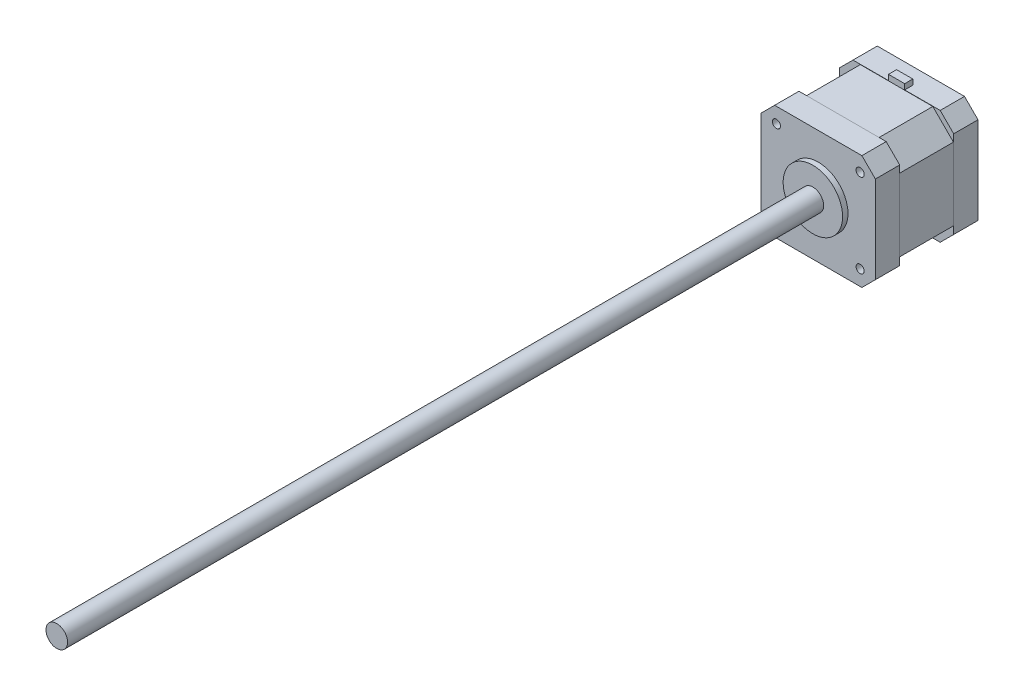
ISO-10303-21;
HEADER;
FILE_DESCRIPTION(('STEP AP214'),'2;1');
FILE_NAME('part.step','',(''),(''),'','','');
FILE_SCHEMA(('AUTOMOTIVE_DESIGN { 1 0 10303 214 1 1 1 1 }'));
ENDSEC;
DATA;
#1=APPLICATION_CONTEXT('core data for automotive mechanical design processes');
#2=APPLICATION_PROTOCOL_DEFINITION('international standard','automotive_design',2000,#1);
#3=PRODUCT_CONTEXT('',#1,'mechanical');
#4=PRODUCT('Part','Part','',(#3));
#5=PRODUCT_RELATED_PRODUCT_CATEGORY('part','',(#4));
#6=PRODUCT_DEFINITION_FORMATION('','',#4);
#7=PRODUCT_DEFINITION_CONTEXT('part definition',#1,'design');
#8=PRODUCT_DEFINITION('design','',#6,#7);
#9=PRODUCT_DEFINITION_SHAPE('','',#8);
#10=(LENGTH_UNIT() NAMED_UNIT(*) SI_UNIT(.MILLI.,.METRE.));
#11=(NAMED_UNIT(*) PLANE_ANGLE_UNIT() SI_UNIT($,.RADIAN.));
#12=(NAMED_UNIT(*) SI_UNIT($,.STERADIAN.) SOLID_ANGLE_UNIT());
#13=UNCERTAINTY_MEASURE_WITH_UNIT(LENGTH_MEASURE(1.E-05),#10,'distance_accuracy_value','');
#14=(GEOMETRIC_REPRESENTATION_CONTEXT(3) GLOBAL_UNCERTAINTY_ASSIGNED_CONTEXT((#13)) GLOBAL_UNIT_ASSIGNED_CONTEXT((#10,
#11,#12)) REPRESENTATION_CONTEXT('',''));
#15=CARTESIAN_POINT('',(0.,0.,0.));
#16=DIRECTION('',(0.,0.,1.));
#17=DIRECTION('',(1.,0.,0.));
#18=AXIS2_PLACEMENT_3D('',#15,#16,#17);
#19=CARTESIAN_POINT('',(-3.,23.15,-32.));
#20=DIRECTION('',(0.,0.,1.));
#21=DIRECTION('',(1.,0.,0.));
#22=AXIS2_PLACEMENT_3D('',#19,#20,#21);
#23=PLANE('',#22);
#24=DIRECTION('',(0.,1.,0.));
#25=VECTOR('',#24,1.);
#26=CARTESIAN_POINT('',(-3.,23.15,-32.));
#27=LINE('',#26,#25);
#28=CARTESIAN_POINT('',(-3.,21.15,-32.));
#29=VERTEX_POINT('',#28);
#30=CARTESIAN_POINT('',(-3.,23.15,-32.));
#31=VERTEX_POINT('',#30);
#32=EDGE_CURVE('E394',#29,#31,#27,.T.);
#33=ORIENTED_EDGE('',*,*,#32,.T.);
#34=DIRECTION('',(1.,0.,0.));
#35=VECTOR('',#34,1.);
#36=CARTESIAN_POINT('',(0.,23.15,-32.));
#37=LINE('',#36,#35);
#38=CARTESIAN_POINT('',(3.,23.15,-32.));
#39=VERTEX_POINT('',#38);
#40=EDGE_CURVE('E398',#31,#39,#37,.T.);
#41=ORIENTED_EDGE('',*,*,#40,.T.);
#42=DIRECTION('',(0.,1.,0.));
#43=VECTOR('',#42,1.);
#44=CARTESIAN_POINT('',(3.,23.15,-32.));
#45=LINE('',#44,#43);
#46=CARTESIAN_POINT('',(3.,21.15,-32.));
#47=VERTEX_POINT('',#46);
#48=EDGE_CURVE('E400',#39,#47,#45,.F.);
#49=ORIENTED_EDGE('',*,*,#48,.T.);
#50=DIRECTION('',(-1.,0.,0.));
#51=VECTOR('',#50,1.);
#52=CARTESIAN_POINT('',(-21.15,21.15,-32.));
#53=LINE('',#52,#51);
#54=EDGE_CURVE('E386',#29,#47,#53,.F.);
#55=ORIENTED_EDGE('',*,*,#54,.F.);
#56=EDGE_LOOP('',(#33,#41,#49,#55));
#57=FACE_BOUND('',#56,.T.);
#58=ADVANCED_FACE('F17',(#57),#23,.F.);
#59=CARTESIAN_POINT('',(0.,0.,-38.));
#60=DIRECTION('',(0.,0.,1.));
#61=DIRECTION('',(1.,0.,0.));
#62=AXIS2_PLACEMENT_3D('',#59,#60,#61);
#63=PLANE('',#62);
#64=DIRECTION('',(-0.707106781186549,0.707106781186546,0.));
#65=VECTOR('',#64,1.);
#66=CARTESIAN_POINT('',(-21.15,-16.15,-38.));
#67=LINE('',#66,#65);
#68=CARTESIAN_POINT('',(-16.15,-21.15,-38.));
#69=VERTEX_POINT('',#68);
#70=CARTESIAN_POINT('',(-21.15,-16.15,-38.));
#71=VERTEX_POINT('',#70);
#72=EDGE_CURVE('E365',#69,#71,#67,.T.);
#73=ORIENTED_EDGE('',*,*,#72,.T.);
#74=DIRECTION('',(0.,1.,0.));
#75=VECTOR('',#74,1.);
#76=CARTESIAN_POINT('',(-21.15,21.15,-38.));
#77=LINE('',#76,#75);
#78=CARTESIAN_POINT('',(-21.15,16.15,-38.));
#79=VERTEX_POINT('',#78);
#80=EDGE_CURVE('E368',#79,#71,#77,.F.);
#81=ORIENTED_EDGE('',*,*,#80,.F.);
#82=DIRECTION('',(0.707106781186546,0.707106781186549,0.));
#83=VECTOR('',#82,1.);
#84=CARTESIAN_POINT('',(-16.15,21.15,-38.));
#85=LINE('',#84,#83);
#86=CARTESIAN_POINT('',(-16.15,21.15,-38.));
#87=VERTEX_POINT('',#86);
#88=EDGE_CURVE('E376',#79,#87,#85,.T.);
#89=ORIENTED_EDGE('',*,*,#88,.T.);
#90=DIRECTION('',(-1.,0.,0.));
#91=VECTOR('',#90,1.);
#92=CARTESIAN_POINT('',(-21.15,21.15,-38.));
#93=LINE('',#92,#91);
#94=CARTESIAN_POINT('',(16.15,21.15,-38.));
#95=VERTEX_POINT('',#94);
#96=EDGE_CURVE('E378',#95,#87,#93,.T.);
#97=ORIENTED_EDGE('',*,*,#96,.F.);
#98=DIRECTION('',(0.707106781186549,-0.707106781186546,0.));
#99=VECTOR('',#98,1.);
#100=CARTESIAN_POINT('',(21.15,16.15,-38.));
#101=LINE('',#100,#99);
#102=CARTESIAN_POINT('',(21.15,16.15,-38.));
#103=VERTEX_POINT('',#102);
#104=EDGE_CURVE('E404',#95,#103,#101,.T.);
#105=ORIENTED_EDGE('',*,*,#104,.T.);
#106=DIRECTION('',(0.,1.,0.));
#107=VECTOR('',#106,1.);
#108=CARTESIAN_POINT('',(21.15,21.15,-38.));
#109=LINE('',#108,#107);
#110=CARTESIAN_POINT('',(21.15,-16.15,-38.));
#111=VERTEX_POINT('',#110);
#112=EDGE_CURVE('E207',#111,#103,#109,.T.);
#113=ORIENTED_EDGE('',*,*,#112,.F.);
#114=DIRECTION('',(-0.707106781186546,-0.707106781186549,0.));
#115=VECTOR('',#114,1.);
#116=CARTESIAN_POINT('',(16.15,-21.15,-38.));
#117=LINE('',#116,#115);
#118=CARTESIAN_POINT('',(16.15,-21.15,-38.));
#119=VERTEX_POINT('',#118);
#120=EDGE_CURVE('E199',#111,#119,#117,.T.);
#121=ORIENTED_EDGE('',*,*,#120,.T.);
#122=DIRECTION('',(1.,0.,0.));
#123=VECTOR('',#122,1.);
#124=CARTESIAN_POINT('',(-21.15,-21.15,-38.));
#125=LINE('',#124,#123);
#126=EDGE_CURVE('E204',#69,#119,#125,.T.);
#127=ORIENTED_EDGE('',*,*,#126,.F.);
#128=EDGE_LOOP('',(#73,#81,#89,#97,#105,#113,#121,#127));
#129=FACE_BOUND('',#128,.T.);
#130=ADVANCED_FACE('F203',(#129),#63,.F.);
#131=CARTESIAN_POINT('',(-21.15,-21.15,-38.));
#132=DIRECTION('',(0.,-1.,0.));
#133=DIRECTION('',(0.,0.,-1.));
#134=AXIS2_PLACEMENT_3D('',#131,#132,#133);
#135=PLANE('',#134);
#136=DIRECTION('',(0.,0.,1.));
#137=VECTOR('',#136,1.);
#138=CARTESIAN_POINT('',(-16.15,-21.15,-38.));
#139=LINE('',#138,#137);
#140=CARTESIAN_POINT('',(-16.15,-21.15,-29.));
#141=VERTEX_POINT('',#140);
#142=EDGE_CURVE('E215',#141,#69,#139,.F.);
#143=ORIENTED_EDGE('',*,*,#142,.T.);
#144=ORIENTED_EDGE('',*,*,#126,.T.);
#145=DIRECTION('',(0.,0.,1.));
#146=VECTOR('',#145,1.);
#147=CARTESIAN_POINT('',(16.15,-21.15,-38.));
#148=LINE('',#147,#146);
#149=CARTESIAN_POINT('',(16.15,-21.15,-29.));
#150=VERTEX_POINT('',#149);
#151=EDGE_CURVE('E209',#119,#150,#148,.T.);
#152=ORIENTED_EDGE('',*,*,#151,.T.);
#153=DIRECTION('',(1.,0.,0.));
#154=VECTOR('',#153,1.);
#155=CARTESIAN_POINT('',(0.,-21.15,-29.));
#156=LINE('',#155,#154);
#157=EDGE_CURVE('E361',#141,#150,#156,.T.);
#158=ORIENTED_EDGE('',*,*,#157,.F.);
#159=EDGE_LOOP('',(#143,#144,#152,#158));
#160=FACE_BOUND('',#159,.T.);
#161=ADVANCED_FACE('F212',(#160),#135,.T.);
#162=CARTESIAN_POINT('',(16.15,-21.15,-38.));
#163=DIRECTION('',(-0.707106781186549,0.707106781186546,0.));
#164=DIRECTION('',(-0.707106781186546,-0.707106781186549,0.));
#165=AXIS2_PLACEMENT_3D('',#162,#163,#164);
#166=PLANE('',#165);
#167=ORIENTED_EDGE('',*,*,#151,.F.);
#168=ORIENTED_EDGE('',*,*,#120,.F.);
#169=DIRECTION('',(0.,0.,-1.));
#170=VECTOR('',#169,1.);
#171=CARTESIAN_POINT('',(21.15,-16.15,-38.));
#172=LINE('',#171,#170);
#173=CARTESIAN_POINT('',(21.15,-16.15,-29.));
#174=VERTEX_POINT('',#173);
#175=EDGE_CURVE('E222',#174,#111,#172,.T.);
#176=ORIENTED_EDGE('',*,*,#175,.F.);
#177=DIRECTION('',(0.707106781186547,0.707106781186547,0.));
#178=VECTOR('',#177,1.);
#179=CARTESIAN_POINT('',(16.15,-21.15,-29.));
#180=LINE('',#179,#178);
#181=EDGE_CURVE('E220',#150,#174,#180,.T.);
#182=ORIENTED_EDGE('',*,*,#181,.F.);
#183=EDGE_LOOP('',(#167,#168,#176,#182));
#184=FACE_BOUND('',#183,.T.);
#185=ADVANCED_FACE('F218',(#184),#166,.F.);
#186=CARTESIAN_POINT('',(21.15,21.15,-38.));
#187=DIRECTION('',(1.,0.,0.));
#188=DIRECTION('',(0.,0.,-1.));
#189=AXIS2_PLACEMENT_3D('',#186,#187,#188);
#190=PLANE('',#189);
#191=ORIENTED_EDGE('',*,*,#175,.T.);
#192=ORIENTED_EDGE('',*,*,#112,.T.);
#193=DIRECTION('',(0.,0.,1.));
#194=VECTOR('',#193,1.);
#195=CARTESIAN_POINT('',(21.15,16.15,-38.));
#196=LINE('',#195,#194);
#197=CARTESIAN_POINT('',(21.15,16.15,-29.));
#198=VERTEX_POINT('',#197);
#199=EDGE_CURVE('E402',#103,#198,#196,.T.);
#200=ORIENTED_EDGE('',*,*,#199,.T.);
#201=DIRECTION('',(0.,1.,0.));
#202=VECTOR('',#201,1.);
#203=CARTESIAN_POINT('',(21.15,0.,-29.));
#204=LINE('',#203,#202);
#205=EDGE_CURVE('E357',#174,#198,#204,.T.);
#206=ORIENTED_EDGE('',*,*,#205,.F.);
#207=EDGE_LOOP('',(#191,#192,#200,#206));
#208=FACE_BOUND('',#207,.T.);
#209=ADVANCED_FACE('F407',(#208),#190,.T.);
#210=CARTESIAN_POINT('',(21.15,16.15,-38.));
#211=DIRECTION('',(-0.707106781186546,-0.707106781186549,0.));
#212=DIRECTION('',(0.707106781186549,-0.707106781186546,0.));
#213=AXIS2_PLACEMENT_3D('',#210,#211,#212);
#214=PLANE('',#213);
#215=DIRECTION('',(-0.707106781186547,0.707106781186547,0.));
#216=VECTOR('',#215,1.);
#217=CARTESIAN_POINT('',(21.15,16.15,-29.));
#218=LINE('',#217,#216);
#219=CARTESIAN_POINT('',(16.15,21.15,-29.));
#220=VERTEX_POINT('',#219);
#221=EDGE_CURVE('E354',#198,#220,#218,.T.);
#222=ORIENTED_EDGE('',*,*,#221,.F.);
#223=ORIENTED_EDGE('',*,*,#199,.F.);
#224=ORIENTED_EDGE('',*,*,#104,.F.);
#225=DIRECTION('',(0.,0.,1.));
#226=VECTOR('',#225,1.);
#227=CARTESIAN_POINT('',(16.15,21.15,-38.));
#228=LINE('',#227,#226);
#229=EDGE_CURVE('E381',#220,#95,#228,.F.);
#230=ORIENTED_EDGE('',*,*,#229,.F.);
#231=EDGE_LOOP('',(#222,#223,#224,#230));
#232=FACE_BOUND('',#231,.T.);
#233=ADVANCED_FACE('F411',(#232),#214,.F.);
#234=CARTESIAN_POINT('',(3.,23.15,-29.));
#235=DIRECTION('',(-1.,0.,0.));
#236=DIRECTION('',(0.,0.,1.));
#237=AXIS2_PLACEMENT_3D('',#234,#235,#236);
#238=PLANE('',#237);
#239=ORIENTED_EDGE('',*,*,#48,.F.);
#240=DIRECTION('',(0.,0.,-1.));
#241=VECTOR('',#240,1.);
#242=CARTESIAN_POINT('',(3.,23.15,0.));
#243=LINE('',#242,#241);
#244=CARTESIAN_POINT('',(3.,23.15,-29.));
#245=VERTEX_POINT('',#244);
#246=EDGE_CURVE('E396',#39,#245,#243,.F.);
#247=ORIENTED_EDGE('',*,*,#246,.T.);
#248=DIRECTION('',(0.,1.,0.));
#249=VECTOR('',#248,1.);
#250=CARTESIAN_POINT('',(3.,0.,-29.));
#251=LINE('',#250,#249);
#252=CARTESIAN_POINT('',(3.,21.15,-29.));
#253=VERTEX_POINT('',#252);
#254=EDGE_CURVE('E348',#253,#245,#251,.T.);
#255=ORIENTED_EDGE('',*,*,#254,.F.);
#256=DIRECTION('',(0.,0.,1.));
#257=VECTOR('',#256,1.);
#258=CARTESIAN_POINT('',(3.,21.15,-38.));
#259=LINE('',#258,#257);
#260=EDGE_CURVE('E384',#47,#253,#259,.T.);
#261=ORIENTED_EDGE('',*,*,#260,.F.);
#262=EDGE_LOOP('',(#239,#247,#255,#261));
#263=FACE_BOUND('',#262,.T.);
#264=ADVANCED_FACE('F436',(#263),#238,.F.);
#265=CARTESIAN_POINT('',(0.,23.15,0.));
#266=DIRECTION('',(0.,-1.,0.));
#267=DIRECTION('',(0.,0.,-1.));
#268=AXIS2_PLACEMENT_3D('',#265,#266,#267);
#269=PLANE('',#268);
#270=DIRECTION('',(1.,0.,0.));
#271=VECTOR('',#270,1.);
#272=CARTESIAN_POINT('',(0.,23.15,-29.));
#273=LINE('',#272,#271);
#274=CARTESIAN_POINT('',(-3.,23.15,-29.));
#275=VERTEX_POINT('',#274);
#276=EDGE_CURVE('E345',#245,#275,#273,.F.);
#277=ORIENTED_EDGE('',*,*,#276,.F.);
#278=ORIENTED_EDGE('',*,*,#246,.F.);
#279=ORIENTED_EDGE('',*,*,#40,.F.);
#280=DIRECTION('',(0.,0.,-1.));
#281=VECTOR('',#280,1.);
#282=CARTESIAN_POINT('',(-3.,23.15,-29.));
#283=LINE('',#282,#281);
#284=EDGE_CURVE('E392',#31,#275,#283,.F.);
#285=ORIENTED_EDGE('',*,*,#284,.T.);
#286=EDGE_LOOP('',(#277,#278,#279,#285));
#287=FACE_BOUND('',#286,.T.);
#288=ADVANCED_FACE('F440',(#287),#269,.F.);
#289=CARTESIAN_POINT('',(-3.,23.15,-29.));
#290=DIRECTION('',(1.,0.,0.));
#291=DIRECTION('',(0.,0.,-1.));
#292=AXIS2_PLACEMENT_3D('',#289,#290,#291);
#293=PLANE('',#292);
#294=DIRECTION('',(0.,1.,0.));
#295=VECTOR('',#294,1.);
#296=CARTESIAN_POINT('',(-3.,0.,-29.));
#297=LINE('',#296,#295);
#298=CARTESIAN_POINT('',(-3.,21.15,-29.));
#299=VERTEX_POINT('',#298);
#300=EDGE_CURVE('E342',#275,#299,#297,.F.);
#301=ORIENTED_EDGE('',*,*,#300,.F.);
#302=ORIENTED_EDGE('',*,*,#284,.F.);
#303=ORIENTED_EDGE('',*,*,#32,.F.);
#304=DIRECTION('',(0.,0.,1.));
#305=VECTOR('',#304,1.);
#306=CARTESIAN_POINT('',(-3.,21.15,-38.));
#307=LINE('',#306,#305);
#308=EDGE_CURVE('E389',#299,#29,#307,.F.);
#309=ORIENTED_EDGE('',*,*,#308,.F.);
#310=EDGE_LOOP('',(#301,#302,#303,#309));
#311=FACE_BOUND('',#310,.T.);
#312=ADVANCED_FACE('F444',(#311),#293,.F.);
#313=CARTESIAN_POINT('',(-21.15,21.15,-38.));
#314=DIRECTION('',(0.,1.,0.));
#315=DIRECTION('',(-1.,0.,0.));
#316=AXIS2_PLACEMENT_3D('',#313,#314,#315);
#317=PLANE('',#316);
#318=DIRECTION('',(0.,0.,1.));
#319=VECTOR('',#318,1.);
#320=CARTESIAN_POINT('',(-16.15,21.15,-38.));
#321=LINE('',#320,#319);
#322=CARTESIAN_POINT('',(-16.15,21.15,-29.));
#323=VERTEX_POINT('',#322);
#324=EDGE_CURVE('E374',#87,#323,#321,.T.);
#325=ORIENTED_EDGE('',*,*,#324,.T.);
#326=DIRECTION('',(1.,0.,0.));
#327=VECTOR('',#326,1.);
#328=CARTESIAN_POINT('',(0.,21.15,-29.));
#329=LINE('',#328,#327);
#330=EDGE_CURVE('E339',#299,#323,#329,.F.);
#331=ORIENTED_EDGE('',*,*,#330,.F.);
#332=ORIENTED_EDGE('',*,*,#308,.T.);
#333=ORIENTED_EDGE('',*,*,#54,.T.);
#334=ORIENTED_EDGE('',*,*,#260,.T.);
#335=DIRECTION('',(1.,0.,0.));
#336=VECTOR('',#335,1.);
#337=CARTESIAN_POINT('',(0.,21.15,-29.));
#338=LINE('',#337,#336);
#339=EDGE_CURVE('E351',#220,#253,#338,.F.);
#340=ORIENTED_EDGE('',*,*,#339,.F.);
#341=ORIENTED_EDGE('',*,*,#229,.T.);
#342=ORIENTED_EDGE('',*,*,#96,.T.);
#343=EDGE_LOOP('',(#325,#331,#332,#333,#334,#340,#341,#342));
#344=FACE_BOUND('',#343,.T.);
#345=ADVANCED_FACE('F429',(#344),#317,.T.);
#346=CARTESIAN_POINT('',(-16.15,21.15,-38.));
#347=DIRECTION('',(0.707106781186549,-0.707106781186546,0.));
#348=DIRECTION('',(0.707106781186546,0.707106781186549,0.));
#349=AXIS2_PLACEMENT_3D('',#346,#347,#348);
#350=PLANE('',#349);
#351=DIRECTION('',(-0.707106781186547,-0.707106781186547,0.));
#352=VECTOR('',#351,1.);
#353=CARTESIAN_POINT('',(-16.15,21.15,-29.));
#354=LINE('',#353,#352);
#355=CARTESIAN_POINT('',(-21.15,16.15,-29.));
#356=VERTEX_POINT('',#355);
#357=EDGE_CURVE('E336',#323,#356,#354,.T.);
#358=ORIENTED_EDGE('',*,*,#357,.F.);
#359=ORIENTED_EDGE('',*,*,#324,.F.);
#360=ORIENTED_EDGE('',*,*,#88,.F.);
#361=DIRECTION('',(0.,0.,1.));
#362=VECTOR('',#361,1.);
#363=CARTESIAN_POINT('',(-21.15,16.15,-38.));
#364=LINE('',#363,#362);
#365=EDGE_CURVE('E371',#356,#79,#364,.F.);
#366=ORIENTED_EDGE('',*,*,#365,.F.);
#367=EDGE_LOOP('',(#358,#359,#360,#366));
#368=FACE_BOUND('',#367,.T.);
#369=ADVANCED_FACE('F426',(#368),#350,.F.);
#370=CARTESIAN_POINT('',(-21.15,21.15,-38.));
#371=DIRECTION('',(-1.,0.,0.));
#372=DIRECTION('',(0.,0.,1.));
#373=AXIS2_PLACEMENT_3D('',#370,#371,#372);
#374=PLANE('',#373);
#375=ORIENTED_EDGE('',*,*,#365,.T.);
#376=ORIENTED_EDGE('',*,*,#80,.T.);
#377=DIRECTION('',(0.,0.,1.));
#378=VECTOR('',#377,1.);
#379=CARTESIAN_POINT('',(-21.15,-16.15,-38.));
#380=LINE('',#379,#378);
#381=CARTESIAN_POINT('',(-21.15,-16.15,-29.));
#382=VERTEX_POINT('',#381);
#383=EDGE_CURVE('E363',#71,#382,#380,.T.);
#384=ORIENTED_EDGE('',*,*,#383,.T.);
#385=DIRECTION('',(0.,1.,0.));
#386=VECTOR('',#385,1.);
#387=CARTESIAN_POINT('',(-21.15,0.,-29.));
#388=LINE('',#387,#386);
#389=EDGE_CURVE('E333',#356,#382,#388,.F.);
#390=ORIENTED_EDGE('',*,*,#389,.F.);
#391=EDGE_LOOP('',(#375,#376,#384,#390));
#392=FACE_BOUND('',#391,.T.);
#393=ADVANCED_FACE('F422',(#392),#374,.T.);
#394=CARTESIAN_POINT('',(-21.15,-16.15,-38.));
#395=DIRECTION('',(0.707106781186546,0.707106781186549,0.));
#396=DIRECTION('',(-0.707106781186549,0.707106781186546,0.));
#397=AXIS2_PLACEMENT_3D('',#394,#395,#396);
#398=PLANE('',#397);
#399=ORIENTED_EDGE('',*,*,#383,.F.);
#400=ORIENTED_EDGE('',*,*,#72,.F.);
#401=ORIENTED_EDGE('',*,*,#142,.F.);
#402=DIRECTION('',(0.707106781186547,-0.707106781186547,0.));
#403=VECTOR('',#402,1.);
#404=CARTESIAN_POINT('',(-21.15,-16.15,-29.));
#405=LINE('',#404,#403);
#406=EDGE_CURVE('E330',#382,#141,#405,.T.);
#407=ORIENTED_EDGE('',*,*,#406,.F.);
#408=EDGE_LOOP('',(#399,#400,#401,#407));
#409=FACE_BOUND('',#408,.T.);
#410=ADVANCED_FACE('F419',(#409),#398,.F.);
#411=CARTESIAN_POINT('',(0.,0.,-29.));
#412=DIRECTION('',(0.,0.,1.));
#413=DIRECTION('',(1.,0.,0.));
#414=AXIS2_PLACEMENT_3D('',#411,#412,#413);
#415=PLANE('',#414);
#416=DIRECTION('',(1.,0.,0.));
#417=VECTOR('',#416,1.);
#418=CARTESIAN_POINT('',(-21.05,21.05,-29.));
#419=LINE('',#418,#417);
#420=CARTESIAN_POINT('',(13.4215728752538,21.05,-29.));
#421=VERTEX_POINT('',#420);
#422=CARTESIAN_POINT('',(-13.4215728752538,21.05,-29.));
#423=VERTEX_POINT('',#422);
#424=EDGE_CURVE('E314',#421,#423,#419,.F.);
#425=ORIENTED_EDGE('',*,*,#424,.F.);
#426=DIRECTION('',(0.707106781186548,-0.707106781186548,0.));
#427=VECTOR('',#426,1.);
#428=CARTESIAN_POINT('',(13.3215728752538,21.15,-29.));
#429=LINE('',#428,#427);
#430=CARTESIAN_POINT('',(21.05,13.4215728752538,-29.));
#431=VERTEX_POINT('',#430);
#432=EDGE_CURVE('E309',#421,#431,#429,.T.);
#433=ORIENTED_EDGE('',*,*,#432,.T.);
#434=DIRECTION('',(0.,1.,0.));
#435=VECTOR('',#434,1.);
#436=CARTESIAN_POINT('',(21.05,-21.05,-29.));
#437=LINE('',#436,#435);
#438=CARTESIAN_POINT('',(21.05,-13.4215728752538,-29.));
#439=VERTEX_POINT('',#438);
#440=EDGE_CURVE('E303',#439,#431,#437,.T.);
#441=ORIENTED_EDGE('',*,*,#440,.F.);
#442=DIRECTION('',(-0.707106781186548,-0.707106781186548,0.));
#443=VECTOR('',#442,1.);
#444=CARTESIAN_POINT('',(13.3215728752538,-21.15,-29.));
#445=LINE('',#444,#443);
#446=CARTESIAN_POINT('',(13.4215728752538,-21.05,-29.));
#447=VERTEX_POINT('',#446);
#448=EDGE_CURVE('E295',#439,#447,#445,.T.);
#449=ORIENTED_EDGE('',*,*,#448,.T.);
#450=DIRECTION('',(1.,0.,0.));
#451=VECTOR('',#450,1.);
#452=CARTESIAN_POINT('',(-21.05,-21.05,-29.));
#453=LINE('',#452,#451);
#454=CARTESIAN_POINT('',(-13.4215728752538,-21.05,-29.));
#455=VERTEX_POINT('',#454);
#456=EDGE_CURVE('E288',#455,#447,#453,.T.);
#457=ORIENTED_EDGE('',*,*,#456,.F.);
#458=DIRECTION('',(-0.707106781186548,0.707106781186548,0.));
#459=VECTOR('',#458,1.);
#460=CARTESIAN_POINT('',(-13.3215728752538,-21.15,-29.));
#461=LINE('',#460,#459);
#462=CARTESIAN_POINT('',(-21.05,-13.4215728752538,-29.));
#463=VERTEX_POINT('',#462);
#464=EDGE_CURVE('E328',#455,#463,#461,.T.);
#465=ORIENTED_EDGE('',*,*,#464,.T.);
#466=DIRECTION('',(0.,1.,0.));
#467=VECTOR('',#466,1.);
#468=CARTESIAN_POINT('',(-21.05,-21.05,-29.));
#469=LINE('',#468,#467);
#470=CARTESIAN_POINT('',(-21.05,13.4215728752538,-29.));
#471=VERTEX_POINT('',#470);
#472=EDGE_CURVE('E322',#471,#463,#469,.F.);
#473=ORIENTED_EDGE('',*,*,#472,.F.);
#474=DIRECTION('',(0.707106781186548,0.707106781186548,0.));
#475=VECTOR('',#474,1.);
#476=CARTESIAN_POINT('',(-13.3215728752538,21.15,-29.));
#477=LINE('',#476,#475);
#478=EDGE_CURVE('E317',#471,#423,#477,.T.);
#479=ORIENTED_EDGE('',*,*,#478,.T.);
#480=EDGE_LOOP('',(#425,#433,#441,#449,#457,#465,#473,#479));
#481=FACE_BOUND('',#480,.T.);
#482=ORIENTED_EDGE('',*,*,#389,.T.);
#483=ORIENTED_EDGE('',*,*,#406,.T.);
#484=ORIENTED_EDGE('',*,*,#157,.T.);
#485=ORIENTED_EDGE('',*,*,#181,.T.);
#486=ORIENTED_EDGE('',*,*,#205,.T.);
#487=ORIENTED_EDGE('',*,*,#221,.T.);
#488=ORIENTED_EDGE('',*,*,#339,.T.);
#489=ORIENTED_EDGE('',*,*,#254,.T.);
#490=ORIENTED_EDGE('',*,*,#276,.T.);
#491=ORIENTED_EDGE('',*,*,#300,.T.);
#492=ORIENTED_EDGE('',*,*,#330,.T.);
#493=ORIENTED_EDGE('',*,*,#357,.T.);
#494=EDGE_LOOP('',(#482,#483,#484,#485,#486,#487,#488,#489,#490,#491,#492,#493));
#495=FACE_BOUND('',#494,.T.);
#496=ADVANCED_FACE('F415',(#481,#495),#415,.T.);
#497=CARTESIAN_POINT('',(-13.3215728752538,-21.15,-29.));
#498=DIRECTION('',(0.707106781186548,0.707106781186548,0.));
#499=DIRECTION('',(-0.707106781186548,0.707106781186548,0.));
#500=AXIS2_PLACEMENT_3D('',#497,#498,#499);
#501=PLANE('',#500);
#502=ORIENTED_EDGE('',*,*,#464,.F.);
#503=DIRECTION('',(0.,0.,-1.));
#504=VECTOR('',#503,1.);
#505=CARTESIAN_POINT('',(-13.4215728752538,-21.05,-29.));
#506=LINE('',#505,#504);
#507=CARTESIAN_POINT('',(-13.4215728752538,-21.05,-8.99999999999999));
#508=VERTEX_POINT('',#507);
#509=EDGE_CURVE('E291',#508,#455,#506,.T.);
#510=ORIENTED_EDGE('',*,*,#509,.F.);
#511=DIRECTION('',(-0.707106781186548,0.707106781186548,0.));
#512=VECTOR('',#511,1.);
#513=CARTESIAN_POINT('',(-13.4215728752538,-21.05,-9.));
#514=LINE('',#513,#512);
#515=CARTESIAN_POINT('',(-21.05,-13.4215728752538,-8.99999999999999));
#516=VERTEX_POINT('',#515);
#517=EDGE_CURVE('E286',#508,#516,#514,.T.);
#518=ORIENTED_EDGE('',*,*,#517,.T.);
#519=DIRECTION('',(0.,0.,1.));
#520=VECTOR('',#519,1.);
#521=CARTESIAN_POINT('',(-21.05,-13.4215728752538,-29.));
#522=LINE('',#521,#520);
#523=EDGE_CURVE('E325',#463,#516,#522,.T.);
#524=ORIENTED_EDGE('',*,*,#523,.F.);
#525=EDGE_LOOP('',(#502,#510,#518,#524));
#526=FACE_BOUND('',#525,.T.);
#527=ADVANCED_FACE('F567',(#526),#501,.F.);
#528=CARTESIAN_POINT('',(-21.05,-21.05,-29.));
#529=DIRECTION('',(-1.,0.,0.));
#530=DIRECTION('',(0.,0.,1.));
#531=AXIS2_PLACEMENT_3D('',#528,#529,#530);
#532=PLANE('',#531);
#533=DIRECTION('',(0.,0.,1.));
#534=VECTOR('',#533,1.);
#535=CARTESIAN_POINT('',(-21.05,13.4215728752538,-29.));
#536=LINE('',#535,#534);
#537=CARTESIAN_POINT('',(-21.05,13.4215728752538,-9.));
#538=VERTEX_POINT('',#537);
#539=EDGE_CURVE('E319',#538,#471,#536,.F.);
#540=ORIENTED_EDGE('',*,*,#539,.T.);
#541=ORIENTED_EDGE('',*,*,#472,.T.);
#542=ORIENTED_EDGE('',*,*,#523,.T.);
#543=DIRECTION('',(0.,1.,0.));
#544=VECTOR('',#543,1.);
#545=CARTESIAN_POINT('',(-21.05,0.,-9.));
#546=LINE('',#545,#544);
#547=EDGE_CURVE('E284',#516,#538,#546,.T.);
#548=ORIENTED_EDGE('',*,*,#547,.T.);
#549=EDGE_LOOP('',(#540,#541,#542,#548));
#550=FACE_BOUND('',#549,.T.);
#551=ADVANCED_FACE('F563',(#550),#532,.T.);
#552=CARTESIAN_POINT('',(-13.3215728752538,21.15,-29.));
#553=DIRECTION('',(0.707106781186548,-0.707106781186548,0.));
#554=DIRECTION('',(0.707106781186548,0.707106781186548,0.));
#555=AXIS2_PLACEMENT_3D('',#552,#553,#554);
#556=PLANE('',#555);
#557=ORIENTED_EDGE('',*,*,#478,.F.);
#558=ORIENTED_EDGE('',*,*,#539,.F.);
#559=DIRECTION('',(0.707106781186548,0.707106781186548,0.));
#560=VECTOR('',#559,1.);
#561=CARTESIAN_POINT('',(-21.05,13.4215728752538,-9.));
#562=LINE('',#561,#560);
#563=CARTESIAN_POINT('',(-13.4215728752538,21.05,-8.99999999999999));
#564=VERTEX_POINT('',#563);
#565=EDGE_CURVE('E282',#538,#564,#562,.T.);
#566=ORIENTED_EDGE('',*,*,#565,.T.);
#567=DIRECTION('',(0.,0.,1.));
#568=VECTOR('',#567,1.);
#569=CARTESIAN_POINT('',(-13.4215728752538,21.05,-29.));
#570=LINE('',#569,#568);
#571=EDGE_CURVE('E311',#423,#564,#570,.T.);
#572=ORIENTED_EDGE('',*,*,#571,.F.);
#573=EDGE_LOOP('',(#557,#558,#566,#572));
#574=FACE_BOUND('',#573,.T.);
#575=ADVANCED_FACE('F559',(#574),#556,.F.);
#576=CARTESIAN_POINT('',(-21.05,21.05,-29.));
#577=DIRECTION('',(0.,1.,0.));
#578=DIRECTION('',(0.,0.,1.));
#579=AXIS2_PLACEMENT_3D('',#576,#577,#578);
#580=PLANE('',#579);
#581=ORIENTED_EDGE('',*,*,#571,.T.);
#582=DIRECTION('',(1.,0.,0.));
#583=VECTOR('',#582,1.);
#584=CARTESIAN_POINT('',(0.,21.05,-9.));
#585=LINE('',#584,#583);
#586=CARTESIAN_POINT('',(13.4215728752538,21.05,-9.));
#587=VERTEX_POINT('',#586);
#588=EDGE_CURVE('E280',#564,#587,#585,.T.);
#589=ORIENTED_EDGE('',*,*,#588,.T.);
#590=DIRECTION('',(0.,0.,1.));
#591=VECTOR('',#590,1.);
#592=CARTESIAN_POINT('',(13.4215728752538,21.05,-29.));
#593=LINE('',#592,#591);
#594=EDGE_CURVE('E306',#587,#421,#593,.F.);
#595=ORIENTED_EDGE('',*,*,#594,.T.);
#596=ORIENTED_EDGE('',*,*,#424,.T.);
#597=EDGE_LOOP('',(#581,#589,#595,#596));
#598=FACE_BOUND('',#597,.T.);
#599=ADVANCED_FACE('F555',(#598),#580,.T.);
#600=CARTESIAN_POINT('',(13.3215728752538,21.15,-29.));
#601=DIRECTION('',(-0.707106781186548,-0.707106781186548,0.));
#602=DIRECTION('',(0.707106781186548,-0.707106781186548,0.));
#603=AXIS2_PLACEMENT_3D('',#600,#601,#602);
#604=PLANE('',#603);
#605=DIRECTION('',(0.707106781186548,-0.707106781186548,0.));
#606=VECTOR('',#605,1.);
#607=CARTESIAN_POINT('',(13.4215728752538,21.05,-9.));
#608=LINE('',#607,#606);
#609=CARTESIAN_POINT('',(21.05,13.4215728752538,-8.99999999999999));
#610=VERTEX_POINT('',#609);
#611=EDGE_CURVE('E278',#587,#610,#608,.T.);
#612=ORIENTED_EDGE('',*,*,#611,.T.);
#613=DIRECTION('',(0.,0.,-1.));
#614=VECTOR('',#613,1.);
#615=CARTESIAN_POINT('',(21.05,13.4215728752538,-29.));
#616=LINE('',#615,#614);
#617=EDGE_CURVE('E300',#431,#610,#616,.F.);
#618=ORIENTED_EDGE('',*,*,#617,.F.);
#619=ORIENTED_EDGE('',*,*,#432,.F.);
#620=ORIENTED_EDGE('',*,*,#594,.F.);
#621=EDGE_LOOP('',(#612,#618,#619,#620));
#622=FACE_BOUND('',#621,.T.);
#623=ADVANCED_FACE('F551',(#622),#604,.F.);
#624=CARTESIAN_POINT('',(21.05,-21.05,-29.));
#625=DIRECTION('',(1.,0.,0.));
#626=DIRECTION('',(0.,0.,-1.));
#627=AXIS2_PLACEMENT_3D('',#624,#625,#626);
#628=PLANE('',#627);
#629=ORIENTED_EDGE('',*,*,#617,.T.);
#630=DIRECTION('',(0.,1.,0.));
#631=VECTOR('',#630,1.);
#632=CARTESIAN_POINT('',(21.05,0.,-9.));
#633=LINE('',#632,#631);
#634=CARTESIAN_POINT('',(21.05,-13.4215728752538,-9.));
#635=VERTEX_POINT('',#634);
#636=EDGE_CURVE('E272',#610,#635,#633,.F.);
#637=ORIENTED_EDGE('',*,*,#636,.T.);
#638=DIRECTION('',(0.,0.,1.));
#639=VECTOR('',#638,1.);
#640=CARTESIAN_POINT('',(21.05,-13.4215728752538,-29.));
#641=LINE('',#640,#639);
#642=EDGE_CURVE('E297',#635,#439,#641,.F.);
#643=ORIENTED_EDGE('',*,*,#642,.T.);
#644=ORIENTED_EDGE('',*,*,#440,.T.);
#645=EDGE_LOOP('',(#629,#637,#643,#644));
#646=FACE_BOUND('',#645,.T.);
#647=ADVANCED_FACE('F547',(#646),#628,.T.);
#648=CARTESIAN_POINT('',(13.3215728752538,-21.15,-29.));
#649=DIRECTION('',(-0.707106781186548,0.707106781186548,0.));
#650=DIRECTION('',(-0.707106781186548,-0.707106781186548,0.));
#651=AXIS2_PLACEMENT_3D('',#648,#649,#650);
#652=PLANE('',#651);
#653=ORIENTED_EDGE('',*,*,#448,.F.);
#654=ORIENTED_EDGE('',*,*,#642,.F.);
#655=DIRECTION('',(-0.707106781186548,-0.707106781186548,0.));
#656=VECTOR('',#655,1.);
#657=CARTESIAN_POINT('',(21.05,-13.4215728752538,-9.));
#658=LINE('',#657,#656);
#659=CARTESIAN_POINT('',(13.4215728752538,-21.05,-8.99999999999999));
#660=VERTEX_POINT('',#659);
#661=EDGE_CURVE('E265',#635,#660,#658,.T.);
#662=ORIENTED_EDGE('',*,*,#661,.T.);
#663=DIRECTION('',(0.,0.,-1.));
#664=VECTOR('',#663,1.);
#665=CARTESIAN_POINT('',(13.4215728752538,-21.05,-29.));
#666=LINE('',#665,#664);
#667=EDGE_CURVE('E293',#447,#660,#666,.F.);
#668=ORIENTED_EDGE('',*,*,#667,.F.);
#669=EDGE_LOOP('',(#653,#654,#662,#668));
#670=FACE_BOUND('',#669,.T.);
#671=ADVANCED_FACE('F544',(#670),#652,.F.);
#672=CARTESIAN_POINT('',(-21.05,-21.05,-29.));
#673=DIRECTION('',(0.,-1.,0.));
#674=DIRECTION('',(0.,0.,-1.));
#675=AXIS2_PLACEMENT_3D('',#672,#673,#674);
#676=PLANE('',#675);
#677=ORIENTED_EDGE('',*,*,#509,.T.);
#678=ORIENTED_EDGE('',*,*,#456,.T.);
#679=ORIENTED_EDGE('',*,*,#667,.T.);
#680=DIRECTION('',(1.,0.,0.));
#681=VECTOR('',#680,1.);
#682=CARTESIAN_POINT('',(0.,-21.05,-9.));
#683=LINE('',#682,#681);
#684=EDGE_CURVE('E261',#660,#508,#683,.F.);
#685=ORIENTED_EDGE('',*,*,#684,.T.);
#686=EDGE_LOOP('',(#677,#678,#679,#685));
#687=FACE_BOUND('',#686,.T.);
#688=ADVANCED_FACE('F541',(#687),#676,.T.);
#689=CARTESIAN_POINT('',(-15.5,-15.5,-4.5));
#690=DIRECTION('',(0.,0.,1.));
#691=DIRECTION('',(1.,0.,0.));
#692=AXIS2_PLACEMENT_3D('',#689,#690,#691);
#693=PLANE('',#692);
#694=CARTESIAN_POINT('',(-15.5,-15.5,-4.5));
#695=DIRECTION('',(0.,0.,-1.));
#696=DIRECTION('',(-1.,0.,0.));
#697=AXIS2_PLACEMENT_3D('',#694,#695,#696);
#698=CIRCLE('',#697,1.5);
#699=CARTESIAN_POINT('',(-17.,-15.5,-4.5));
#700=VERTEX_POINT('',#699);
#701=EDGE_CURVE('E20',#700,#700,#698,.F.);
#702=ORIENTED_EDGE('',*,*,#701,.T.);
#703=EDGE_LOOP('',(#702));
#704=FACE_BOUND('',#703,.T.);
#705=ADVANCED_FACE('F538',(#704),#693,.T.);
#706=CARTESIAN_POINT('',(15.5,-15.5,-4.5));
#707=DIRECTION('',(0.,0.,1.));
#708=DIRECTION('',(1.,0.,0.));
#709=AXIS2_PLACEMENT_3D('',#706,#707,#708);
#710=PLANE('',#709);
#711=CARTESIAN_POINT('',(15.5,-15.5,-4.5));
#712=DIRECTION('',(0.,0.,-1.));
#713=DIRECTION('',(-1.,0.,0.));
#714=AXIS2_PLACEMENT_3D('',#711,#712,#713);
#715=CIRCLE('',#714,1.5);
#716=CARTESIAN_POINT('',(14.,-15.5,-4.5));
#717=VERTEX_POINT('',#716);
#718=EDGE_CURVE('E256',#717,#717,#715,.F.);
#719=ORIENTED_EDGE('',*,*,#718,.T.);
#720=EDGE_LOOP('',(#719));
#721=FACE_BOUND('',#720,.T.);
#722=ADVANCED_FACE('F534',(#721),#710,.T.);
#723=CARTESIAN_POINT('',(15.5,15.5,-4.5));
#724=DIRECTION('',(0.,0.,1.));
#725=DIRECTION('',(1.,0.,0.));
#726=AXIS2_PLACEMENT_3D('',#723,#724,#725);
#727=PLANE('',#726);
#728=CARTESIAN_POINT('',(15.5,15.5,-4.5));
#729=DIRECTION('',(0.,0.,-1.));
#730=DIRECTION('',(-1.,0.,0.));
#731=AXIS2_PLACEMENT_3D('',#728,#729,#730);
#732=CIRCLE('',#731,1.5);
#733=CARTESIAN_POINT('',(14.,15.5,-4.5));
#734=VERTEX_POINT('',#733);
#735=EDGE_CURVE('E254',#734,#734,#732,.F.);
#736=ORIENTED_EDGE('',*,*,#735,.T.);
#737=EDGE_LOOP('',(#736));
#738=FACE_BOUND('',#737,.T.);
#739=ADVANCED_FACE('F530',(#738),#727,.T.);
#740=CARTESIAN_POINT('',(-15.5,15.5,-4.5));
#741=DIRECTION('',(0.,0.,1.));
#742=DIRECTION('',(1.,0.,0.));
#743=AXIS2_PLACEMENT_3D('',#740,#741,#742);
#744=PLANE('',#743);
#745=CARTESIAN_POINT('',(-15.5,15.5,-4.5));
#746=DIRECTION('',(0.,0.,-1.));
#747=DIRECTION('',(-1.,0.,0.));
#748=AXIS2_PLACEMENT_3D('',#745,#746,#747);
#749=CIRCLE('',#748,1.5);
#750=CARTESIAN_POINT('',(-17.,15.5,-4.5));
#751=VERTEX_POINT('',#750);
#752=EDGE_CURVE('E250',#751,#751,#749,.F.);
#753=ORIENTED_EDGE('',*,*,#752,.T.);
#754=EDGE_LOOP('',(#753));
#755=FACE_BOUND('',#754,.T.);
#756=ADVANCED_FACE('F526',(#755),#744,.T.);
#757=CARTESIAN_POINT('',(0.,0.,-9.));
#758=DIRECTION('',(0.,0.,1.));
#759=DIRECTION('',(1.,0.,0.));
#760=AXIS2_PLACEMENT_3D('',#757,#758,#759);
#761=PLANE('',#760);
#762=ORIENTED_EDGE('',*,*,#661,.F.);
#763=ORIENTED_EDGE('',*,*,#636,.F.);
#764=ORIENTED_EDGE('',*,*,#611,.F.);
#765=ORIENTED_EDGE('',*,*,#588,.F.);
#766=ORIENTED_EDGE('',*,*,#565,.F.);
#767=ORIENTED_EDGE('',*,*,#547,.F.);
#768=ORIENTED_EDGE('',*,*,#517,.F.);
#769=ORIENTED_EDGE('',*,*,#684,.F.);
#770=EDGE_LOOP('',(#762,#763,#764,#765,#766,#767,#768,#769));
#771=FACE_BOUND('',#770,.T.);
#772=DIRECTION('',(1.,0.,0.));
#773=VECTOR('',#772,1.);
#774=CARTESIAN_POINT('',(-21.15,-21.15,-9.));
#775=LINE('',#774,#773);
#776=CARTESIAN_POINT('',(-16.15,-21.15,-9.));
#777=VERTEX_POINT('',#776);
#778=CARTESIAN_POINT('',(16.15,-21.15,-9.));
#779=VERTEX_POINT('',#778);
#780=EDGE_CURVE('E990',#777,#779,#775,.T.);
#781=ORIENTED_EDGE('',*,*,#780,.F.);
#782=DIRECTION('',(-0.707106781186549,0.707106781186546,0.));
#783=VECTOR('',#782,1.);
#784=CARTESIAN_POINT('',(-21.15,-16.15,-9.));
#785=LINE('',#784,#783);
#786=CARTESIAN_POINT('',(-21.15,-16.15,-9.));
#787=VERTEX_POINT('',#786);
#788=EDGE_CURVE('E992',#777,#787,#785,.T.);
#789=ORIENTED_EDGE('',*,*,#788,.T.);
#790=DIRECTION('',(0.,1.,0.));
#791=VECTOR('',#790,1.);
#792=CARTESIAN_POINT('',(-21.15,21.15,-9.));
#793=LINE('',#792,#791);
#794=CARTESIAN_POINT('',(-21.15,16.15,-9.));
#795=VERTEX_POINT('',#794);
#796=EDGE_CURVE('E253',#795,#787,#793,.F.);
#797=ORIENTED_EDGE('',*,*,#796,.F.);
#798=DIRECTION('',(0.707106781186546,0.707106781186549,0.));
#799=VECTOR('',#798,1.);
#800=CARTESIAN_POINT('',(-16.15,21.15,-9.));
#801=LINE('',#800,#799);
#802=CARTESIAN_POINT('',(-16.15,21.15,-9.));
#803=VERTEX_POINT('',#802);
#804=EDGE_CURVE('E249',#795,#803,#801,.T.);
#805=ORIENTED_EDGE('',*,*,#804,.T.);
#806=DIRECTION('',(-1.,0.,0.));
#807=VECTOR('',#806,1.);
#808=CARTESIAN_POINT('',(-21.15,21.15,-9.));
#809=LINE('',#808,#807);
#810=CARTESIAN_POINT('',(16.15,21.15,-9.));
#811=VERTEX_POINT('',#810);
#812=EDGE_CURVE('E1032',#811,#803,#809,.T.);
#813=ORIENTED_EDGE('',*,*,#812,.F.);
#814=DIRECTION('',(0.707106781186549,-0.707106781186546,0.));
#815=VECTOR('',#814,1.);
#816=CARTESIAN_POINT('',(21.15,16.15,-9.));
#817=LINE('',#816,#815);
#818=CARTESIAN_POINT('',(21.15,16.15,-9.));
#819=VERTEX_POINT('',#818);
#820=EDGE_CURVE('E1034',#811,#819,#817,.T.);
#821=ORIENTED_EDGE('',*,*,#820,.T.);
#822=DIRECTION('',(0.,1.,0.));
#823=VECTOR('',#822,1.);
#824=CARTESIAN_POINT('',(21.15,21.15,-9.));
#825=LINE('',#824,#823);
#826=CARTESIAN_POINT('',(21.15,-16.15,-9.));
#827=VERTEX_POINT('',#826);
#828=EDGE_CURVE('E1042',#827,#819,#825,.T.);
#829=ORIENTED_EDGE('',*,*,#828,.F.);
#830=DIRECTION('',(-0.707106781186546,-0.707106781186549,0.));
#831=VECTOR('',#830,1.);
#832=CARTESIAN_POINT('',(16.15,-21.15,-9.));
#833=LINE('',#832,#831);
#834=EDGE_CURVE('E995',#827,#779,#833,.T.);
#835=ORIENTED_EDGE('',*,*,#834,.T.);
#836=EDGE_LOOP('',(#781,#789,#797,#805,#813,#821,#829,#835));
#837=FACE_BOUND('',#836,.T.);
#838=ADVANCED_FACE('F522',(#771,#837),#761,.F.);
#839=CARTESIAN_POINT('',(-15.5,-15.5,-4.5));
#840=DIRECTION('',(0.,0.,-1.));
#841=DIRECTION('',(-1.,0.,0.));
#842=AXIS2_PLACEMENT_3D('',#839,#840,#841);
#843=CYLINDRICAL_SURFACE('',#842,1.5);
#844=ORIENTED_EDGE('',*,*,#701,.F.);
#845=EDGE_LOOP('',(#844));
#846=FACE_BOUND('',#845,.T.);
#847=CARTESIAN_POINT('',(-15.5,-15.5,0.));
#848=DIRECTION('',(0.,0.,-1.));
#849=DIRECTION('',(-1.,0.,0.));
#850=AXIS2_PLACEMENT_3D('',#847,#848,#849);
#851=CIRCLE('',#850,1.5);
#852=CARTESIAN_POINT('',(-17.,-15.5,0.));
#853=VERTEX_POINT('',#852);
#854=EDGE_CURVE('E246',#853,#853,#851,.T.);
#855=ORIENTED_EDGE('',*,*,#854,.F.);
#856=EDGE_LOOP('',(#855));
#857=FACE_BOUND('',#856,.T.);
#858=ADVANCED_FACE('F518',(#846,#857),#843,.F.);
#859=CARTESIAN_POINT('',(15.5,-15.5,-4.5));
#860=DIRECTION('',(0.,0.,-1.));
#861=DIRECTION('',(-1.,0.,0.));
#862=AXIS2_PLACEMENT_3D('',#859,#860,#861);
#863=CYLINDRICAL_SURFACE('',#862,1.5);
#864=ORIENTED_EDGE('',*,*,#718,.F.);
#865=EDGE_LOOP('',(#864));
#866=FACE_BOUND('',#865,.T.);
#867=CARTESIAN_POINT('',(15.5,-15.5,0.));
#868=DIRECTION('',(0.,0.,-1.));
#869=DIRECTION('',(-1.,0.,0.));
#870=AXIS2_PLACEMENT_3D('',#867,#868,#869);
#871=CIRCLE('',#870,1.5);
#872=CARTESIAN_POINT('',(14.,-15.5,0.));
#873=VERTEX_POINT('',#872);
#874=EDGE_CURVE('E243',#873,#873,#871,.T.);
#875=ORIENTED_EDGE('',*,*,#874,.F.);
#876=EDGE_LOOP('',(#875));
#877=FACE_BOUND('',#876,.T.);
#878=ADVANCED_FACE('F514',(#866,#877),#863,.F.);
#879=CARTESIAN_POINT('',(15.5,15.5,-4.5));
#880=DIRECTION('',(0.,0.,-1.));
#881=DIRECTION('',(-1.,0.,0.));
#882=AXIS2_PLACEMENT_3D('',#879,#880,#881);
#883=CYLINDRICAL_SURFACE('',#882,1.5);
#884=ORIENTED_EDGE('',*,*,#735,.F.);
#885=EDGE_LOOP('',(#884));
#886=FACE_BOUND('',#885,.T.);
#887=CARTESIAN_POINT('',(15.5,15.5,0.));
#888=DIRECTION('',(0.,0.,-1.));
#889=DIRECTION('',(-1.,0.,0.));
#890=AXIS2_PLACEMENT_3D('',#887,#888,#889);
#891=CIRCLE('',#890,1.5);
#892=CARTESIAN_POINT('',(14.,15.5,0.));
#893=VERTEX_POINT('',#892);
#894=EDGE_CURVE('E240',#893,#893,#891,.T.);
#895=ORIENTED_EDGE('',*,*,#894,.F.);
#896=EDGE_LOOP('',(#895));
#897=FACE_BOUND('',#896,.T.);
#898=ADVANCED_FACE('F510',(#886,#897),#883,.F.);
#899=CARTESIAN_POINT('',(-15.5,15.5,-4.5));
#900=DIRECTION('',(0.,0.,-1.));
#901=DIRECTION('',(-1.,0.,0.));
#902=AXIS2_PLACEMENT_3D('',#899,#900,#901);
#903=CYLINDRICAL_SURFACE('',#902,1.5);
#904=ORIENTED_EDGE('',*,*,#752,.F.);
#905=EDGE_LOOP('',(#904));
#906=FACE_BOUND('',#905,.T.);
#907=CARTESIAN_POINT('',(-15.5,15.5,0.));
#908=DIRECTION('',(0.,0.,-1.));
#909=DIRECTION('',(-1.,0.,0.));
#910=AXIS2_PLACEMENT_3D('',#907,#908,#909);
#911=CIRCLE('',#910,1.5);
#912=CARTESIAN_POINT('',(-17.,15.5,0.));
#913=VERTEX_POINT('',#912);
#914=EDGE_CURVE('E236',#913,#913,#911,.T.);
#915=ORIENTED_EDGE('',*,*,#914,.F.);
#916=EDGE_LOOP('',(#915));
#917=FACE_BOUND('',#916,.T.);
#918=ADVANCED_FACE('F506',(#906,#917),#903,.F.);
#919=CARTESIAN_POINT('',(-21.15,21.15,-38.));
#920=DIRECTION('',(-1.,0.,0.));
#921=DIRECTION('',(0.,0.,1.));
#922=AXIS2_PLACEMENT_3D('',#919,#920,#921);
#923=PLANE('',#922);
#924=DIRECTION('',(0.,1.,0.));
#925=VECTOR('',#924,1.);
#926=CARTESIAN_POINT('',(-21.15,0.,0.));
#927=LINE('',#926,#925);
#928=CARTESIAN_POINT('',(-21.15,16.15,0.));
#929=VERTEX_POINT('',#928);
#930=CARTESIAN_POINT('',(-21.15,-16.15,0.));
#931=VERTEX_POINT('',#930);
#932=EDGE_CURVE('E239',#929,#931,#927,.F.);
#933=ORIENTED_EDGE('',*,*,#932,.F.);
#934=DIRECTION('',(0.,0.,1.));
#935=VECTOR('',#934,1.);
#936=CARTESIAN_POINT('',(-21.15,16.15,-38.));
#937=LINE('',#936,#935);
#938=EDGE_CURVE('E1026',#929,#795,#937,.F.);
#939=ORIENTED_EDGE('',*,*,#938,.T.);
#940=ORIENTED_EDGE('',*,*,#796,.T.);
#941=DIRECTION('',(0.,0.,1.));
#942=VECTOR('',#941,1.);
#943=CARTESIAN_POINT('',(-21.15,-16.15,-38.));
#944=LINE('',#943,#942);
#945=EDGE_CURVE('E999',#787,#931,#944,.T.);
#946=ORIENTED_EDGE('',*,*,#945,.T.);
#947=EDGE_LOOP('',(#933,#939,#940,#946));
#948=FACE_BOUND('',#947,.T.);
#949=ADVANCED_FACE('F502',(#948),#923,.T.);
#950=CARTESIAN_POINT('',(-21.15,-16.15,-38.));
#951=DIRECTION('',(0.707106781186546,0.707106781186549,0.));
#952=DIRECTION('',(-0.707106781186549,0.707106781186546,0.));
#953=AXIS2_PLACEMENT_3D('',#950,#951,#952);
#954=PLANE('',#953);
#955=ORIENTED_EDGE('',*,*,#788,.F.);
#956=DIRECTION('',(0.,0.,-1.));
#957=VECTOR('',#956,1.);
#958=CARTESIAN_POINT('',(-16.15,-21.15,-38.));
#959=LINE('',#958,#957);
#960=CARTESIAN_POINT('',(-16.15,-21.15,0.));
#961=VERTEX_POINT('',#960);
#962=EDGE_CURVE('E998',#961,#777,#959,.T.);
#963=ORIENTED_EDGE('',*,*,#962,.F.);
#964=DIRECTION('',(0.707106781186547,-0.707106781186547,0.));
#965=VECTOR('',#964,1.);
#966=CARTESIAN_POINT('',(-21.15,-16.15,0.));
#967=LINE('',#966,#965);
#968=EDGE_CURVE('E1015',#931,#961,#967,.T.);
#969=ORIENTED_EDGE('',*,*,#968,.F.);
#970=ORIENTED_EDGE('',*,*,#945,.F.);
#971=EDGE_LOOP('',(#955,#963,#969,#970));
#972=FACE_BOUND('',#971,.T.);
#973=ADVANCED_FACE('F498',(#972),#954,.F.);
#974=CARTESIAN_POINT('',(-21.15,-21.15,-38.));
#975=DIRECTION('',(0.,-1.,0.));
#976=DIRECTION('',(0.,0.,-1.));
#977=AXIS2_PLACEMENT_3D('',#974,#975,#976);
#978=PLANE('',#977);
#979=DIRECTION('',(1.,0.,0.));
#980=VECTOR('',#979,1.);
#981=CARTESIAN_POINT('',(0.,-21.15,0.));
#982=LINE('',#981,#980);
#983=CARTESIAN_POINT('',(16.15,-21.15,0.));
#984=VERTEX_POINT('',#983);
#985=EDGE_CURVE('E1005',#961,#984,#982,.T.);
#986=ORIENTED_EDGE('',*,*,#985,.F.);
#987=ORIENTED_EDGE('',*,*,#962,.T.);
#988=ORIENTED_EDGE('',*,*,#780,.T.);
#989=DIRECTION('',(0.,0.,1.));
#990=VECTOR('',#989,1.);
#991=CARTESIAN_POINT('',(16.15,-21.15,-38.));
#992=LINE('',#991,#990);
#993=EDGE_CURVE('E1008',#779,#984,#992,.T.);
#994=ORIENTED_EDGE('',*,*,#993,.T.);
#995=EDGE_LOOP('',(#986,#987,#988,#994));
#996=FACE_BOUND('',#995,.T.);
#997=ADVANCED_FACE('F494',(#996),#978,.T.);
#998=CARTESIAN_POINT('',(16.15,-21.15,-38.));
#999=DIRECTION('',(-0.707106781186549,0.707106781186546,0.));
#1000=DIRECTION('',(-0.707106781186546,-0.707106781186549,0.));
#1001=AXIS2_PLACEMENT_3D('',#998,#999,#1000);
#1002=PLANE('',#1001);
#1003=ORIENTED_EDGE('',*,*,#834,.F.);
#1004=DIRECTION('',(0.,0.,-1.));
#1005=VECTOR('',#1004,1.);
#1006=CARTESIAN_POINT('',(21.15,-16.15,-38.));
#1007=LINE('',#1006,#1005);
#1008=CARTESIAN_POINT('',(21.15,-16.15,0.));
#1009=VERTEX_POINT('',#1008);
#1010=EDGE_CURVE('E1039',#1009,#827,#1007,.T.);
#1011=ORIENTED_EDGE('',*,*,#1010,.F.);
#1012=DIRECTION('',(0.707106781186547,0.707106781186547,0.));
#1013=VECTOR('',#1012,1.);
#1014=CARTESIAN_POINT('',(16.15,-21.15,0.));
#1015=LINE('',#1014,#1013);
#1016=EDGE_CURVE('E1045',#984,#1009,#1015,.T.);
#1017=ORIENTED_EDGE('',*,*,#1016,.F.);
#1018=ORIENTED_EDGE('',*,*,#993,.F.);
#1019=EDGE_LOOP('',(#1003,#1011,#1017,#1018));
#1020=FACE_BOUND('',#1019,.T.);
#1021=ADVANCED_FACE('F490',(#1020),#1002,.F.);
#1022=CARTESIAN_POINT('',(21.15,21.15,-38.));
#1023=DIRECTION('',(1.,0.,0.));
#1024=DIRECTION('',(0.,0.,-1.));
#1025=AXIS2_PLACEMENT_3D('',#1022,#1023,#1024);
#1026=PLANE('',#1025);
#1027=DIRECTION('',(0.,1.,0.));
#1028=VECTOR('',#1027,1.);
#1029=CARTESIAN_POINT('',(21.15,0.,0.));
#1030=LINE('',#1029,#1028);
#1031=CARTESIAN_POINT('',(21.15,16.15,0.));
#1032=VERTEX_POINT('',#1031);
#1033=EDGE_CURVE('E1048',#1009,#1032,#1030,.T.);
#1034=ORIENTED_EDGE('',*,*,#1033,.F.);
#1035=ORIENTED_EDGE('',*,*,#1010,.T.);
#1036=ORIENTED_EDGE('',*,*,#828,.T.);
#1037=DIRECTION('',(0.,0.,1.));
#1038=VECTOR('',#1037,1.);
#1039=CARTESIAN_POINT('',(21.15,16.15,-38.));
#1040=LINE('',#1039,#1038);
#1041=EDGE_CURVE('E1037',#819,#1032,#1040,.T.);
#1042=ORIENTED_EDGE('',*,*,#1041,.T.);
#1043=EDGE_LOOP('',(#1034,#1035,#1036,#1042));
#1044=FACE_BOUND('',#1043,.T.);
#1045=ADVANCED_FACE('F486',(#1044),#1026,.T.);
#1046=CARTESIAN_POINT('',(21.15,16.15,-38.));
#1047=DIRECTION('',(-0.707106781186546,-0.707106781186549,0.));
#1048=DIRECTION('',(0.707106781186549,-0.707106781186546,0.));
#1049=AXIS2_PLACEMENT_3D('',#1046,#1047,#1048);
#1050=PLANE('',#1049);
#1051=DIRECTION('',(0.,0.,1.));
#1052=VECTOR('',#1051,1.);
#1053=CARTESIAN_POINT('',(16.15,21.15,-38.));
#1054=LINE('',#1053,#1052);
#1055=CARTESIAN_POINT('',(16.15,21.15,0.));
#1056=VERTEX_POINT('',#1055);
#1057=EDGE_CURVE('E1029',#1056,#811,#1054,.F.);
#1058=ORIENTED_EDGE('',*,*,#1057,.F.);
#1059=DIRECTION('',(-0.707106781186547,0.707106781186547,0.));
#1060=VECTOR('',#1059,1.);
#1061=CARTESIAN_POINT('',(21.15,16.15,0.));
#1062=LINE('',#1061,#1060);
#1063=EDGE_CURVE('E1052',#1032,#1056,#1062,.T.);
#1064=ORIENTED_EDGE('',*,*,#1063,.F.);
#1065=ORIENTED_EDGE('',*,*,#1041,.F.);
#1066=ORIENTED_EDGE('',*,*,#820,.F.);
#1067=EDGE_LOOP('',(#1058,#1064,#1065,#1066));
#1068=FACE_BOUND('',#1067,.T.);
#1069=ADVANCED_FACE('F483',(#1068),#1050,.F.);
#1070=CARTESIAN_POINT('',(-21.15,21.15,-38.));
#1071=DIRECTION('',(0.,1.,0.));
#1072=DIRECTION('',(-1.,0.,0.));
#1073=AXIS2_PLACEMENT_3D('',#1070,#1071,#1072);
#1074=PLANE('',#1073);
#1075=DIRECTION('',(1.,0.,0.));
#1076=VECTOR('',#1075,1.);
#1077=CARTESIAN_POINT('',(0.,21.15,0.));
#1078=LINE('',#1077,#1076);
#1079=CARTESIAN_POINT('',(-16.15,21.15,0.));
#1080=VERTEX_POINT('',#1079);
#1081=EDGE_CURVE('E1055',#1056,#1080,#1078,.F.);
#1082=ORIENTED_EDGE('',*,*,#1081,.F.);
#1083=ORIENTED_EDGE('',*,*,#1057,.T.);
#1084=ORIENTED_EDGE('',*,*,#812,.T.);
#1085=DIRECTION('',(0.,0.,1.));
#1086=VECTOR('',#1085,1.);
#1087=CARTESIAN_POINT('',(-16.15,21.15,-38.));
#1088=LINE('',#1087,#1086);
#1089=EDGE_CURVE('E35',#803,#1080,#1088,.T.);
#1090=ORIENTED_EDGE('',*,*,#1089,.T.);
#1091=EDGE_LOOP('',(#1082,#1083,#1084,#1090));
#1092=FACE_BOUND('',#1091,.T.);
#1093=ADVANCED_FACE('F479',(#1092),#1074,.T.);
#1094=CARTESIAN_POINT('',(-16.15,21.15,-38.));
#1095=DIRECTION('',(0.707106781186549,-0.707106781186546,0.));
#1096=DIRECTION('',(0.707106781186546,0.707106781186549,0.));
#1097=AXIS2_PLACEMENT_3D('',#1094,#1095,#1096);
#1098=PLANE('',#1097);
#1099=ORIENTED_EDGE('',*,*,#938,.F.);
#1100=DIRECTION('',(-0.707106781186547,-0.707106781186547,0.));
#1101=VECTOR('',#1100,1.);
#1102=CARTESIAN_POINT('',(-16.15,21.15,0.));
#1103=LINE('',#1102,#1101);
#1104=EDGE_CURVE('E235',#1080,#929,#1103,.T.);
#1105=ORIENTED_EDGE('',*,*,#1104,.F.);
#1106=ORIENTED_EDGE('',*,*,#1089,.F.);
#1107=ORIENTED_EDGE('',*,*,#804,.F.);
#1108=EDGE_LOOP('',(#1099,#1105,#1106,#1107));
#1109=FACE_BOUND('',#1108,.T.);
#1110=ADVANCED_FACE('F475',(#1109),#1098,.F.);
#1111=CARTESIAN_POINT('',(0.,0.,0.));
#1112=DIRECTION('',(0.,0.,1.));
#1113=DIRECTION('',(1.,0.,0.));
#1114=AXIS2_PLACEMENT_3D('',#1111,#1112,#1113);
#1115=PLANE('',#1114);
#1116=CARTESIAN_POINT('',(0.,0.,0.));
#1117=DIRECTION('',(0.,0.,1.));
#1118=DIRECTION('',(1.,0.,0.));
#1119=AXIS2_PLACEMENT_3D('',#1116,#1117,#1118);
#1120=CIRCLE('',#1119,11.);
#1121=CARTESIAN_POINT('',(11.,0.,0.));
#1122=VERTEX_POINT('',#1121);
#1123=EDGE_CURVE('E232',#1122,#1122,#1120,.T.);
#1124=ORIENTED_EDGE('',*,*,#1123,.F.);
#1125=EDGE_LOOP('',(#1124));
#1126=FACE_BOUND('',#1125,.T.);
#1127=ORIENTED_EDGE('',*,*,#1081,.T.);
#1128=ORIENTED_EDGE('',*,*,#1104,.T.);
#1129=ORIENTED_EDGE('',*,*,#932,.T.);
#1130=ORIENTED_EDGE('',*,*,#968,.T.);
#1131=ORIENTED_EDGE('',*,*,#985,.T.);
#1132=ORIENTED_EDGE('',*,*,#1016,.T.);
#1133=ORIENTED_EDGE('',*,*,#1033,.T.);
#1134=ORIENTED_EDGE('',*,*,#1063,.T.);
#1135=EDGE_LOOP('',(#1127,#1128,#1129,#1130,#1131,#1132,#1133,#1134));
#1136=FACE_BOUND('',#1135,.T.);
#1137=ORIENTED_EDGE('',*,*,#914,.T.);
#1138=EDGE_LOOP('',(#1137));
#1139=FACE_BOUND('',#1138,.T.);
#1140=ORIENTED_EDGE('',*,*,#894,.T.);
#1141=EDGE_LOOP('',(#1140));
#1142=FACE_BOUND('',#1141,.T.);
#1143=ORIENTED_EDGE('',*,*,#874,.T.);
#1144=EDGE_LOOP('',(#1143));
#1145=FACE_BOUND('',#1144,.T.);
#1146=ORIENTED_EDGE('',*,*,#854,.T.);
#1147=EDGE_LOOP('',(#1146));
#1148=FACE_BOUND('',#1147,.T.);
#1149=ADVANCED_FACE('F471',(#1126,#1136,#1139,#1142,#1145,#1148),#1115,.T.);
#1150=CARTESIAN_POINT('',(0.,0.,2.));
#1151=DIRECTION('',(0.,0.,1.));
#1152=DIRECTION('',(1.,0.,0.));
#1153=AXIS2_PLACEMENT_3D('',#1150,#1151,#1152);
#1154=CYLINDRICAL_SURFACE('',#1153,11.);
#1155=ORIENTED_EDGE('',*,*,#1123,.T.);
#1156=EDGE_LOOP('',(#1155));
#1157=FACE_BOUND('',#1156,.T.);
#1158=CARTESIAN_POINT('',(0.,0.,2.));
#1159=DIRECTION('',(0.,0.,1.));
#1160=DIRECTION('',(1.,0.,0.));
#1161=AXIS2_PLACEMENT_3D('',#1158,#1159,#1160);
#1162=CIRCLE('',#1161,11.);
#1163=CARTESIAN_POINT('',(11.,0.,2.));
#1164=VERTEX_POINT('',#1163);
#1165=EDGE_CURVE('E229',#1164,#1164,#1162,.T.);
#1166=ORIENTED_EDGE('',*,*,#1165,.F.);
#1167=EDGE_LOOP('',(#1166));
#1168=FACE_BOUND('',#1167,.T.);
#1169=ADVANCED_FACE('F467',(#1157,#1168),#1154,.T.);
#1170=CARTESIAN_POINT('',(0.,0.,2.));
#1171=DIRECTION('',(0.,0.,1.));
#1172=DIRECTION('',(1.,0.,0.));
#1173=AXIS2_PLACEMENT_3D('',#1170,#1171,#1172);
#1174=PLANE('',#1173);
#1175=CARTESIAN_POINT('',(0.,0.,2.));
#1176=DIRECTION('',(0.,0.,1.));
#1177=DIRECTION('',(1.,0.,0.));
#1178=AXIS2_PLACEMENT_3D('',#1175,#1176,#1177);
#1179=CIRCLE('',#1178,4.);
#1180=CARTESIAN_POINT('',(4.,0.,2.));
#1181=VERTEX_POINT('',#1180);
#1182=EDGE_CURVE('E26',#1181,#1181,#1179,.T.);
#1183=ORIENTED_EDGE('',*,*,#1182,.F.);
#1184=EDGE_LOOP('',(#1183));
#1185=FACE_BOUND('',#1184,.T.);
#1186=ORIENTED_EDGE('',*,*,#1165,.T.);
#1187=EDGE_LOOP('',(#1186));
#1188=FACE_BOUND('',#1187,.T.);
#1189=ADVANCED_FACE('F460',(#1185,#1188),#1174,.T.);
#1190=CARTESIAN_POINT('',(0.,0.,282.));
#1191=DIRECTION('',(0.,0.,1.));
#1192=DIRECTION('',(1.,0.,0.));
#1193=AXIS2_PLACEMENT_3D('',#1190,#1191,#1192);
#1194=PLANE('',#1193);
#1195=CARTESIAN_POINT('',(0.,0.,282.));
#1196=DIRECTION('',(0.,0.,1.));
#1197=DIRECTION('',(1.,0.,0.));
#1198=AXIS2_PLACEMENT_3D('',#1195,#1196,#1197);
#1199=CIRCLE('',#1198,4.);
#1200=CARTESIAN_POINT('',(4.,0.,282.));
#1201=VERTEX_POINT('',#1200);
#1202=EDGE_CURVE('E10',#1201,#1201,#1199,.F.);
#1203=ORIENTED_EDGE('',*,*,#1202,.F.);
#1204=EDGE_LOOP('',(#1203));
#1205=FACE_BOUND('',#1204,.T.);
#1206=ADVANCED_FACE('F454',(#1205),#1194,.T.);
#1207=CARTESIAN_POINT('',(0.,0.,282.));
#1208=DIRECTION('',(0.,0.,1.));
#1209=DIRECTION('',(1.,0.,0.));
#1210=AXIS2_PLACEMENT_3D('',#1207,#1208,#1209);
#1211=CYLINDRICAL_SURFACE('',#1210,4.);
#1212=ORIENTED_EDGE('',*,*,#1182,.T.);
#1213=EDGE_LOOP('',(#1212));
#1214=FACE_BOUND('',#1213,.T.);
#1215=ORIENTED_EDGE('',*,*,#1202,.T.);
#1216=EDGE_LOOP('',(#1215));
#1217=FACE_BOUND('',#1216,.T.);
#1218=ADVANCED_FACE('F452',(#1214,#1217),#1211,.T.);
#1219=CLOSED_SHELL('',(#58,#130,#161,#185,#209,#233,#264,#288,#312,#345,#369,#393,#410,#496,
#527,#551,#575,#599,#623,#647,#671,#688,#705,#722,#739,#756,#838,#858,#878,#898,#918,#949,#973,
#997,#1021,#1045,#1069,#1093,#1110,#1149,#1169,#1189,#1206,#1218));
#1220=MANIFOLD_SOLID_BREP('B1',#1219);
#1221=ADVANCED_BREP_SHAPE_REPRESENTATION('',(#18,#1220),#14);
#1222=SHAPE_DEFINITION_REPRESENTATION(#9,#1221);
ENDSEC;
END-ISO-10303-21;
